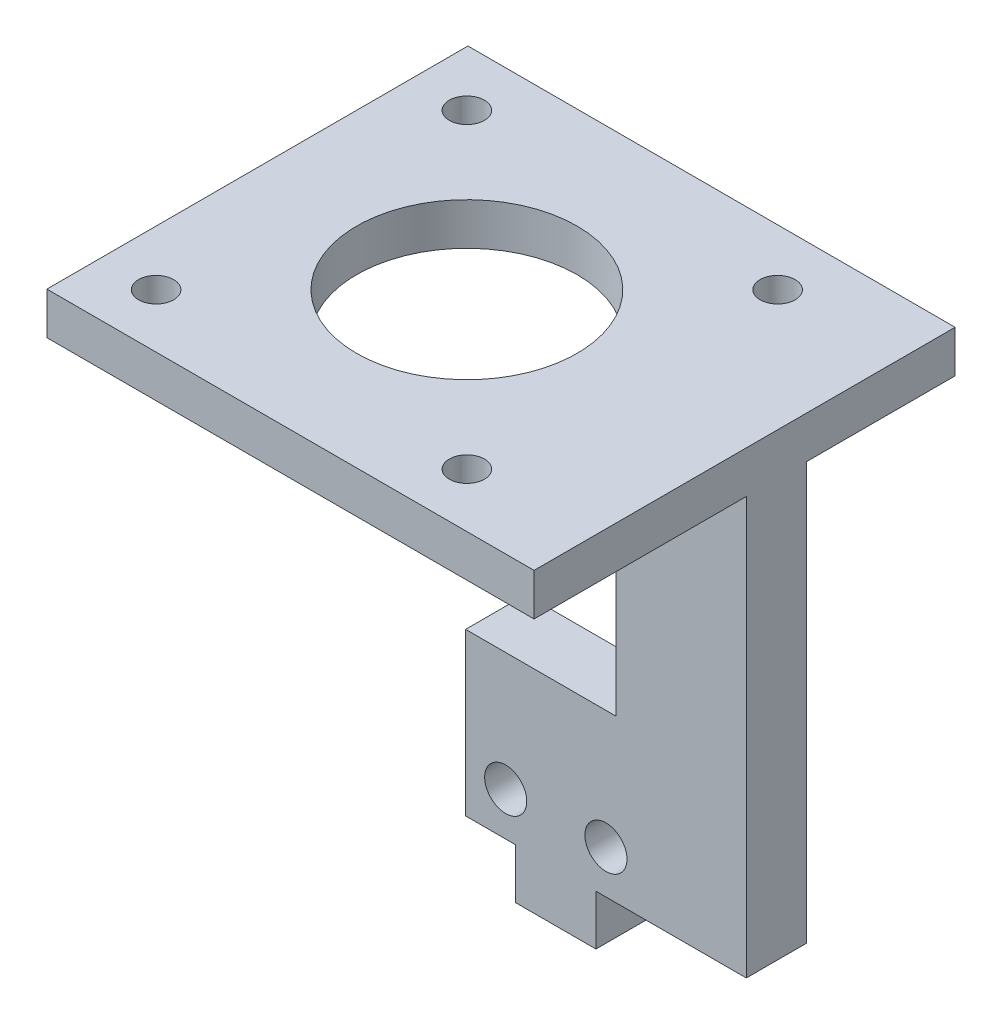
ISO-10303-21;
HEADER;
FILE_DESCRIPTION(('STEP AP214'),'2;1');
FILE_NAME('part.step','',(''),(''),'','','');
FILE_SCHEMA(('AUTOMOTIVE_DESIGN { 1 0 10303 214 1 1 1 1 }'));
ENDSEC;
DATA;
#1=APPLICATION_CONTEXT('core data for automotive mechanical design processes');
#2=APPLICATION_PROTOCOL_DEFINITION('international standard','automotive_design',2000,#1);
#3=PRODUCT_CONTEXT('',#1,'mechanical');
#4=PRODUCT('Part','Part','',(#3));
#5=PRODUCT_RELATED_PRODUCT_CATEGORY('part','',(#4));
#6=PRODUCT_DEFINITION_FORMATION('','',#4);
#7=PRODUCT_DEFINITION_CONTEXT('part definition',#1,'design');
#8=PRODUCT_DEFINITION('design','',#6,#7);
#9=PRODUCT_DEFINITION_SHAPE('','',#8);
#10=(LENGTH_UNIT() NAMED_UNIT(*) SI_UNIT(.MILLI.,.METRE.));
#11=(NAMED_UNIT(*) PLANE_ANGLE_UNIT() SI_UNIT($,.RADIAN.));
#12=(NAMED_UNIT(*) SI_UNIT($,.STERADIAN.) SOLID_ANGLE_UNIT());
#13=UNCERTAINTY_MEASURE_WITH_UNIT(LENGTH_MEASURE(1.E-05),#10,'distance_accuracy_value','');
#14=(GEOMETRIC_REPRESENTATION_CONTEXT(3) GLOBAL_UNCERTAINTY_ASSIGNED_CONTEXT((#13)) GLOBAL_UNIT_ASSIGNED_CONTEXT((#10,
#11,#12)) REPRESENTATION_CONTEXT('',''));
#15=CARTESIAN_POINT('',(0.,0.,0.));
#16=DIRECTION('',(0.,0.,1.));
#17=DIRECTION('',(1.,0.,0.));
#18=AXIS2_PLACEMENT_3D('',#15,#16,#17);
#19=CARTESIAN_POINT('',(0.,0.,6.));
#20=DIRECTION('',(0.,0.,-1.));
#21=DIRECTION('',(-1.,0.,0.));
#22=AXIS2_PLACEMENT_3D('',#19,#20,#21);
#23=PLANE('',#22);
#24=CARTESIAN_POINT('',(14.,4.30447472,6.));
#25=DIRECTION('',(0.,0.,1.));
#26=DIRECTION('',(-1.,0.,0.));
#27=AXIS2_PLACEMENT_3D('',#24,#25,#26);
#28=CIRCLE('',#27,2.1);
#29=CARTESIAN_POINT('',(11.9,4.30447472,6.));
#30=VERTEX_POINT('',#29);
#31=EDGE_CURVE('E229',#30,#30,#28,.T.);
#32=ORIENTED_EDGE('',*,*,#31,.F.);
#33=EDGE_LOOP('',(#32));
#34=FACE_BOUND('',#33,.T.);
#35=CARTESIAN_POINT('',(4.,4.30447472,6.));
#36=DIRECTION('',(0.,0.,1.));
#37=DIRECTION('',(1.,0.,0.));
#38=AXIS2_PLACEMENT_3D('',#35,#36,#37);
#39=CIRCLE('',#38,2.1);
#40=CARTESIAN_POINT('',(6.1,4.30447472,6.));
#41=VERTEX_POINT('',#40);
#42=EDGE_CURVE('E233',#41,#41,#39,.T.);
#43=ORIENTED_EDGE('',*,*,#42,.F.);
#44=EDGE_LOOP('',(#43));
#45=FACE_BOUND('',#44,.T.);
#46=DIRECTION('',(1.,0.,0.));
#47=VECTOR('',#46,1.);
#48=CARTESIAN_POINT('',(0.,41.6,6.));
#49=LINE('',#48,#47);
#50=CARTESIAN_POINT('',(15.,41.6,6.));
#51=VERTEX_POINT('',#50);
#52=CARTESIAN_POINT('',(28.,41.6,6.));
#53=VERTEX_POINT('',#52);
#54=EDGE_CURVE('E176',#51,#53,#49,.T.);
#55=ORIENTED_EDGE('',*,*,#54,.F.);
#56=DIRECTION('',(0.,1.,0.));
#57=VECTOR('',#56,1.);
#58=CARTESIAN_POINT('',(15.,16.1193661254941,6.));
#59=LINE('',#58,#57);
#60=CARTESIAN_POINT('',(15.,16.1193661254941,6.));
#61=VERTEX_POINT('',#60);
#62=EDGE_CURVE('E183',#61,#51,#59,.T.);
#63=ORIENTED_EDGE('',*,*,#62,.F.);
#64=DIRECTION('',(1.,0.,0.));
#65=VECTOR('',#64,1.);
#66=CARTESIAN_POINT('',(0.,16.1193661254941,6.));
#67=LINE('',#66,#65);
#68=CARTESIAN_POINT('',(0.,16.1193661254941,6.));
#69=VERTEX_POINT('',#68);
#70=EDGE_CURVE('E180',#69,#61,#67,.T.);
#71=ORIENTED_EDGE('',*,*,#70,.F.);
#72=DIRECTION('',(0.,-1.,0.));
#73=VECTOR('',#72,1.);
#74=CARTESIAN_POINT('',(0.,0.,6.));
#75=LINE('',#74,#73);
#76=CARTESIAN_POINT('',(0.,0.,6.));
#77=VERTEX_POINT('',#76);
#78=EDGE_CURVE('E242',#69,#77,#75,.T.);
#79=ORIENTED_EDGE('',*,*,#78,.T.);
#80=DIRECTION('',(1.,0.,0.));
#81=VECTOR('',#80,1.);
#82=CARTESIAN_POINT('',(0.,0.,6.));
#83=LINE('',#82,#81);
#84=CARTESIAN_POINT('',(5.,0.,6.));
#85=VERTEX_POINT('',#84);
#86=EDGE_CURVE('E246',#77,#85,#83,.T.);
#87=ORIENTED_EDGE('',*,*,#86,.T.);
#88=DIRECTION('',(0.,1.,0.));
#89=VECTOR('',#88,1.);
#90=CARTESIAN_POINT('',(5.,-5.,6.));
#91=LINE('',#90,#89);
#92=CARTESIAN_POINT('',(5.,-5.,6.));
#93=VERTEX_POINT('',#92);
#94=EDGE_CURVE('E223',#93,#85,#91,.T.);
#95=ORIENTED_EDGE('',*,*,#94,.F.);
#96=DIRECTION('',(-1.,0.,0.));
#97=VECTOR('',#96,1.);
#98=CARTESIAN_POINT('',(13.,-5.,6.));
#99=LINE('',#98,#97);
#100=CARTESIAN_POINT('',(13.,-5.,6.));
#101=VERTEX_POINT('',#100);
#102=EDGE_CURVE('E202',#101,#93,#99,.T.);
#103=ORIENTED_EDGE('',*,*,#102,.F.);
#104=DIRECTION('',(0.,1.,0.));
#105=VECTOR('',#104,1.);
#106=CARTESIAN_POINT('',(13.,-5.,6.));
#107=LINE('',#106,#105);
#108=CARTESIAN_POINT('',(13.,0.,6.));
#109=VERTEX_POINT('',#108);
#110=EDGE_CURVE('E226',#101,#109,#107,.T.);
#111=ORIENTED_EDGE('',*,*,#110,.T.);
#112=CARTESIAN_POINT('',(28.,0.,6.));
#113=VERTEX_POINT('',#112);
#114=EDGE_CURVE('E244',#109,#113,#83,.T.);
#115=ORIENTED_EDGE('',*,*,#114,.T.);
#116=DIRECTION('',(0.,-1.,0.));
#117=VECTOR('',#116,1.);
#118=CARTESIAN_POINT('',(28.,0.,6.));
#119=LINE('',#118,#117);
#120=EDGE_CURVE('E193',#53,#113,#119,.T.);
#121=ORIENTED_EDGE('',*,*,#120,.F.);
#122=EDGE_LOOP('',(#55,#63,#71,#79,#87,#95,#103,#111,#115,#121));
#123=FACE_BOUND('',#122,.T.);
#124=ADVANCED_FACE('F35',(#34,#45,#123),#23,.F.);
#125=CARTESIAN_POINT('',(0.,0.,0.));
#126=DIRECTION('',(0.,0.,-1.));
#127=DIRECTION('',(-1.,0.,0.));
#128=AXIS2_PLACEMENT_3D('',#125,#126,#127);
#129=PLANE('',#128);
#130=CARTESIAN_POINT('',(14.,4.30447472,0.));
#131=DIRECTION('',(0.,0.,1.));
#132=DIRECTION('',(-1.,0.,0.));
#133=AXIS2_PLACEMENT_3D('',#130,#131,#132);
#134=CIRCLE('',#133,2.1);
#135=CARTESIAN_POINT('',(11.9,4.30447472,0.));
#136=VERTEX_POINT('',#135);
#137=EDGE_CURVE('E230',#136,#136,#134,.T.);
#138=ORIENTED_EDGE('',*,*,#137,.T.);
#139=EDGE_LOOP('',(#138));
#140=FACE_BOUND('',#139,.T.);
#141=CARTESIAN_POINT('',(4.,4.30447472,0.));
#142=DIRECTION('',(0.,0.,1.));
#143=DIRECTION('',(1.,0.,0.));
#144=AXIS2_PLACEMENT_3D('',#141,#142,#143);
#145=CIRCLE('',#144,2.1);
#146=CARTESIAN_POINT('',(6.1,4.30447472,0.));
#147=VERTEX_POINT('',#146);
#148=EDGE_CURVE('E236',#147,#147,#145,.T.);
#149=ORIENTED_EDGE('',*,*,#148,.T.);
#150=EDGE_LOOP('',(#149));
#151=FACE_BOUND('',#150,.T.);
#152=DIRECTION('',(0.,-1.,0.));
#153=VECTOR('',#152,1.);
#154=CARTESIAN_POINT('',(15.,0.,0.));
#155=LINE('',#154,#153);
#156=CARTESIAN_POINT('',(15.,41.6,0.));
#157=VERTEX_POINT('',#156);
#158=CARTESIAN_POINT('',(15.,16.1193661254941,0.));
#159=VERTEX_POINT('',#158);
#160=EDGE_CURVE('E57',#157,#159,#155,.T.);
#161=ORIENTED_EDGE('',*,*,#160,.F.);
#162=DIRECTION('',(1.,0.,0.));
#163=VECTOR('',#162,1.);
#164=CARTESIAN_POINT('',(0.,41.6,0.));
#165=LINE('',#164,#163);
#166=CARTESIAN_POINT('',(28.,41.6,0.));
#167=VERTEX_POINT('',#166);
#168=EDGE_CURVE('E169',#157,#167,#165,.T.);
#169=ORIENTED_EDGE('',*,*,#168,.T.);
#170=DIRECTION('',(0.,1.,0.));
#171=VECTOR('',#170,1.);
#172=CARTESIAN_POINT('',(28.,0.,0.));
#173=LINE('',#172,#171);
#174=CARTESIAN_POINT('',(28.,0.,0.));
#175=VERTEX_POINT('',#174);
#176=EDGE_CURVE('E189',#175,#167,#173,.T.);
#177=ORIENTED_EDGE('',*,*,#176,.F.);
#178=DIRECTION('',(1.,0.,0.));
#179=VECTOR('',#178,1.);
#180=CARTESIAN_POINT('',(0.,0.,0.));
#181=LINE('',#180,#179);
#182=CARTESIAN_POINT('',(13.,0.,0.));
#183=VERTEX_POINT('',#182);
#184=EDGE_CURVE('E251',#183,#175,#181,.T.);
#185=ORIENTED_EDGE('',*,*,#184,.F.);
#186=CARTESIAN_POINT('',(5.,0.,0.));
#187=VERTEX_POINT('',#186);
#188=EDGE_CURVE('E253',#187,#183,#181,.T.);
#189=ORIENTED_EDGE('',*,*,#188,.F.);
#190=CARTESIAN_POINT('',(0.,0.,0.));
#191=VERTEX_POINT('',#190);
#192=EDGE_CURVE('E245',#191,#187,#181,.T.);
#193=ORIENTED_EDGE('',*,*,#192,.F.);
#194=DIRECTION('',(0.,-1.,0.));
#195=VECTOR('',#194,1.);
#196=CARTESIAN_POINT('',(0.,0.,0.));
#197=LINE('',#196,#195);
#198=CARTESIAN_POINT('',(0.,16.1193661254941,0.));
#199=VERTEX_POINT('',#198);
#200=EDGE_CURVE('E239',#199,#191,#197,.T.);
#201=ORIENTED_EDGE('',*,*,#200,.F.);
#202=DIRECTION('',(-1.,0.,0.));
#203=VECTOR('',#202,1.);
#204=CARTESIAN_POINT('',(0.,16.1193661254941,0.));
#205=LINE('',#204,#203);
#206=EDGE_CURVE('E256',#159,#199,#205,.T.);
#207=ORIENTED_EDGE('',*,*,#206,.F.);
#208=EDGE_LOOP('',(#161,#169,#177,#185,#189,#193,#201,#207));
#209=FACE_BOUND('',#208,.T.);
#210=ADVANCED_FACE('F304',(#140,#151,#209),#129,.T.);
#211=CARTESIAN_POINT('',(15.,16.1193661254941,-4.));
#212=DIRECTION('',(1.,0.,0.));
#213=DIRECTION('',(0.,0.,-1.));
#214=AXIS2_PLACEMENT_3D('',#211,#212,#213);
#215=PLANE('',#214);
#216=DIRECTION('',(0.,0.,1.));
#217=VECTOR('',#216,1.);
#218=CARTESIAN_POINT('',(15.,41.6,-4.));
#219=LINE('',#218,#217);
#220=EDGE_CURVE('E43',#157,#51,#219,.T.);
#221=ORIENTED_EDGE('',*,*,#220,.F.);
#222=ORIENTED_EDGE('',*,*,#160,.T.);
#223=DIRECTION('',(0.,0.,1.));
#224=VECTOR('',#223,1.);
#225=CARTESIAN_POINT('',(15.,16.1193661254941,-4.));
#226=LINE('',#225,#224);
#227=EDGE_CURVE('E187',#159,#61,#226,.T.);
#228=ORIENTED_EDGE('',*,*,#227,.T.);
#229=ORIENTED_EDGE('',*,*,#62,.T.);
#230=EDGE_LOOP('',(#221,#222,#228,#229));
#231=FACE_BOUND('',#230,.T.);
#232=ADVANCED_FACE('F268',(#231),#215,.F.);
#233=CARTESIAN_POINT('',(28.,0.,0.));
#234=DIRECTION('',(1.,0.,0.));
#235=DIRECTION('',(0.,1.,0.));
#236=AXIS2_PLACEMENT_3D('',#233,#234,#235);
#237=PLANE('',#236);
#238=DIRECTION('',(0.,0.,-1.));
#239=VECTOR('',#238,1.);
#240=CARTESIAN_POINT('',(28.,45.8,6.));
#241=LINE('',#240,#239);
#242=CARTESIAN_POINT('',(28.,45.8,27.17));
#243=VERTEX_POINT('',#242);
#244=CARTESIAN_POINT('',(28.,45.8,-14.83));
#245=VERTEX_POINT('',#244);
#246=EDGE_CURVE('E178',#243,#245,#241,.T.);
#247=ORIENTED_EDGE('',*,*,#246,.F.);
#248=DIRECTION('',(0.,1.,0.));
#249=VECTOR('',#248,1.);
#250=CARTESIAN_POINT('',(28.,41.6,27.17));
#251=LINE('',#250,#249);
#252=CARTESIAN_POINT('',(28.,41.6,27.17));
#253=VERTEX_POINT('',#252);
#254=EDGE_CURVE('E160',#253,#243,#251,.T.);
#255=ORIENTED_EDGE('',*,*,#254,.F.);
#256=DIRECTION('',(0.,0.,-1.));
#257=VECTOR('',#256,1.);
#258=CARTESIAN_POINT('',(28.,41.6,27.17));
#259=LINE('',#258,#257);
#260=EDGE_CURVE('E163',#253,#53,#259,.T.);
#261=ORIENTED_EDGE('',*,*,#260,.T.);
#262=ORIENTED_EDGE('',*,*,#120,.T.);
#263=DIRECTION('',(0.,0.,-1.));
#264=VECTOR('',#263,1.);
#265=CARTESIAN_POINT('',(28.,0.,0.));
#266=LINE('',#265,#264);
#267=EDGE_CURVE('E195',#113,#175,#266,.T.);
#268=ORIENTED_EDGE('',*,*,#267,.T.);
#269=ORIENTED_EDGE('',*,*,#176,.T.);
#270=CARTESIAN_POINT('',(28.,41.6,-14.83));
#271=VERTEX_POINT('',#270);
#272=EDGE_CURVE('E161',#167,#271,#259,.T.);
#273=ORIENTED_EDGE('',*,*,#272,.T.);
#274=DIRECTION('',(0.,1.,0.));
#275=VECTOR('',#274,1.);
#276=CARTESIAN_POINT('',(28.,41.6,-14.83));
#277=LINE('',#276,#275);
#278=EDGE_CURVE('E170',#271,#245,#277,.T.);
#279=ORIENTED_EDGE('',*,*,#278,.T.);
#280=EDGE_LOOP('',(#247,#255,#261,#262,#268,#269,#273,#279));
#281=FACE_BOUND('',#280,.T.);
#282=ADVANCED_FACE('F334',(#281),#237,.T.);
#283=CARTESIAN_POINT('',(0.,0.,6.));
#284=DIRECTION('',(0.,1.,0.));
#285=DIRECTION('',(0.,0.,1.));
#286=AXIS2_PLACEMENT_3D('',#283,#284,#285);
#287=PLANE('',#286);
#288=DIRECTION('',(0.,0.,1.));
#289=VECTOR('',#288,1.);
#290=CARTESIAN_POINT('',(13.,0.,6.));
#291=LINE('',#290,#289);
#292=EDGE_CURVE('E213',#183,#109,#291,.T.);
#293=ORIENTED_EDGE('',*,*,#292,.F.);
#294=ORIENTED_EDGE('',*,*,#184,.T.);
#295=ORIENTED_EDGE('',*,*,#267,.F.);
#296=ORIENTED_EDGE('',*,*,#114,.F.);
#297=EDGE_LOOP('',(#293,#294,#295,#296));
#298=FACE_BOUND('',#297,.T.);
#299=ADVANCED_FACE('F300',(#298),#287,.F.);
#300=DIRECTION('',(0.,0.,-1.));
#301=VECTOR('',#300,1.);
#302=CARTESIAN_POINT('',(5.,0.,6.));
#303=LINE('',#302,#301);
#304=EDGE_CURVE('E214',#85,#187,#303,.T.);
#305=ORIENTED_EDGE('',*,*,#304,.F.);
#306=ORIENTED_EDGE('',*,*,#86,.F.);
#307=DIRECTION('',(0.,0.,-1.));
#308=VECTOR('',#307,1.);
#309=CARTESIAN_POINT('',(0.,0.,6.));
#310=LINE('',#309,#308);
#311=EDGE_CURVE('E249',#77,#191,#310,.T.);
#312=ORIENTED_EDGE('',*,*,#311,.T.);
#313=ORIENTED_EDGE('',*,*,#192,.T.);
#314=EDGE_LOOP('',(#305,#306,#312,#313));
#315=FACE_BOUND('',#314,.T.);
#316=ADVANCED_FACE('F280',(#315),#287,.F.);
#317=CARTESIAN_POINT('',(0.,0.,6.));
#318=DIRECTION('',(1.,0.,0.));
#319=DIRECTION('',(0.,1.,0.));
#320=AXIS2_PLACEMENT_3D('',#317,#318,#319);
#321=PLANE('',#320);
#322=ORIENTED_EDGE('',*,*,#78,.F.);
#323=DIRECTION('',(0.,0.,1.));
#324=VECTOR('',#323,1.);
#325=CARTESIAN_POINT('',(0.,16.1193661254941,-4.));
#326=LINE('',#325,#324);
#327=EDGE_CURVE('E186',#199,#69,#326,.T.);
#328=ORIENTED_EDGE('',*,*,#327,.F.);
#329=ORIENTED_EDGE('',*,*,#200,.T.);
#330=ORIENTED_EDGE('',*,*,#311,.F.);
#331=EDGE_LOOP('',(#322,#328,#329,#330));
#332=FACE_BOUND('',#331,.T.);
#333=ADVANCED_FACE('F37',(#332),#321,.F.);
#334=CARTESIAN_POINT('',(4.,4.30447472,0.));
#335=DIRECTION('',(0.,0.,1.));
#336=DIRECTION('',(1.,0.,0.));
#337=AXIS2_PLACEMENT_3D('',#334,#335,#336);
#338=CYLINDRICAL_SURFACE('',#337,2.1);
#339=ORIENTED_EDGE('',*,*,#148,.F.);
#340=EDGE_LOOP('',(#339));
#341=FACE_BOUND('',#340,.T.);
#342=ORIENTED_EDGE('',*,*,#42,.T.);
#343=EDGE_LOOP('',(#342));
#344=FACE_BOUND('',#343,.T.);
#345=ADVANCED_FACE('F331',(#341,#344),#338,.F.);
#346=CARTESIAN_POINT('',(14.,4.30447472,0.));
#347=DIRECTION('',(0.,0.,1.));
#348=DIRECTION('',(1.,0.,0.));
#349=AXIS2_PLACEMENT_3D('',#346,#347,#348);
#350=CYLINDRICAL_SURFACE('',#349,2.1);
#351=ORIENTED_EDGE('',*,*,#137,.F.);
#352=EDGE_LOOP('',(#351));
#353=FACE_BOUND('',#352,.T.);
#354=ORIENTED_EDGE('',*,*,#31,.T.);
#355=EDGE_LOOP('',(#354));
#356=FACE_BOUND('',#355,.T.);
#357=ADVANCED_FACE('F566',(#353,#356),#350,.F.);
#358=CARTESIAN_POINT('',(13.,-5.,6.));
#359=DIRECTION('',(-1.,0.,0.));
#360=DIRECTION('',(0.,0.,1.));
#361=AXIS2_PLACEMENT_3D('',#358,#359,#360);
#362=PLANE('',#361);
#363=CARTESIAN_POINT('',(13.,0.,-4.));
#364=VERTEX_POINT('',#363);
#365=EDGE_CURVE('E198',#364,#183,#291,.T.);
#366=ORIENTED_EDGE('',*,*,#365,.T.);
#367=ORIENTED_EDGE('',*,*,#292,.T.);
#368=ORIENTED_EDGE('',*,*,#110,.F.);
#369=DIRECTION('',(0.,0.,1.));
#370=VECTOR('',#369,1.);
#371=CARTESIAN_POINT('',(13.,-5.,6.));
#372=LINE('',#371,#370);
#373=CARTESIAN_POINT('',(13.,-5.,-4.));
#374=VERTEX_POINT('',#373);
#375=EDGE_CURVE('E199',#374,#101,#372,.T.);
#376=ORIENTED_EDGE('',*,*,#375,.F.);
#377=DIRECTION('',(0.,1.,0.));
#378=VECTOR('',#377,1.);
#379=CARTESIAN_POINT('',(13.,-5.,-4.));
#380=LINE('',#379,#378);
#381=EDGE_CURVE('E209',#374,#364,#380,.T.);
#382=ORIENTED_EDGE('',*,*,#381,.T.);
#383=EDGE_LOOP('',(#366,#367,#368,#376,#382));
#384=FACE_BOUND('',#383,.T.);
#385=ADVANCED_FACE('F296',(#384),#362,.F.);
#386=CARTESIAN_POINT('',(5.,-5.,6.));
#387=DIRECTION('',(1.,0.,0.));
#388=DIRECTION('',(0.,0.,-1.));
#389=AXIS2_PLACEMENT_3D('',#386,#387,#388);
#390=PLANE('',#389);
#391=ORIENTED_EDGE('',*,*,#304,.T.);
#392=CARTESIAN_POINT('',(5.,0.,-4.));
#393=VERTEX_POINT('',#392);
#394=EDGE_CURVE('E212',#187,#393,#303,.T.);
#395=ORIENTED_EDGE('',*,*,#394,.T.);
#396=DIRECTION('',(0.,1.,0.));
#397=VECTOR('',#396,1.);
#398=CARTESIAN_POINT('',(5.,-5.,-4.));
#399=LINE('',#398,#397);
#400=CARTESIAN_POINT('',(5.,-5.,-4.));
#401=VERTEX_POINT('',#400);
#402=EDGE_CURVE('E220',#401,#393,#399,.T.);
#403=ORIENTED_EDGE('',*,*,#402,.F.);
#404=DIRECTION('',(0.,0.,-1.));
#405=VECTOR('',#404,1.);
#406=CARTESIAN_POINT('',(5.,-5.,6.));
#407=LINE('',#406,#405);
#408=EDGE_CURVE('E205',#93,#401,#407,.T.);
#409=ORIENTED_EDGE('',*,*,#408,.F.);
#410=ORIENTED_EDGE('',*,*,#94,.T.);
#411=EDGE_LOOP('',(#391,#395,#403,#409,#410));
#412=FACE_BOUND('',#411,.T.);
#413=ADVANCED_FACE('F285',(#412),#390,.F.);
#414=CARTESIAN_POINT('',(13.,-5.,-4.));
#415=DIRECTION('',(0.,0.,1.));
#416=DIRECTION('',(1.,0.,0.));
#417=AXIS2_PLACEMENT_3D('',#414,#415,#416);
#418=PLANE('',#417);
#419=DIRECTION('',(1.,0.,0.));
#420=VECTOR('',#419,1.);
#421=CARTESIAN_POINT('',(13.,0.,-4.));
#422=LINE('',#421,#420);
#423=EDGE_CURVE('E203',#393,#364,#422,.T.);
#424=ORIENTED_EDGE('',*,*,#423,.T.);
#425=ORIENTED_EDGE('',*,*,#381,.F.);
#426=DIRECTION('',(1.,0.,0.));
#427=VECTOR('',#426,1.);
#428=CARTESIAN_POINT('',(13.,-5.,-4.));
#429=LINE('',#428,#427);
#430=EDGE_CURVE('E207',#401,#374,#429,.T.);
#431=ORIENTED_EDGE('',*,*,#430,.F.);
#432=ORIENTED_EDGE('',*,*,#402,.T.);
#433=EDGE_LOOP('',(#424,#425,#431,#432));
#434=FACE_BOUND('',#433,.T.);
#435=ADVANCED_FACE('F310',(#434),#418,.F.);
#436=CARTESIAN_POINT('',(0.,-5.,0.));
#437=DIRECTION('',(0.,1.,0.));
#438=DIRECTION('',(0.,0.,1.));
#439=AXIS2_PLACEMENT_3D('',#436,#437,#438);
#440=PLANE('',#439);
#441=ORIENTED_EDGE('',*,*,#375,.T.);
#442=ORIENTED_EDGE('',*,*,#102,.T.);
#443=ORIENTED_EDGE('',*,*,#408,.T.);
#444=ORIENTED_EDGE('',*,*,#430,.T.);
#445=EDGE_LOOP('',(#441,#442,#443,#444));
#446=FACE_BOUND('',#445,.T.);
#447=ADVANCED_FACE('F289',(#446),#440,.F.);
#448=CARTESIAN_POINT('',(0.,0.,0.));
#449=DIRECTION('',(0.,1.,0.));
#450=DIRECTION('',(0.,0.,1.));
#451=AXIS2_PLACEMENT_3D('',#448,#449,#450);
#452=PLANE('',#451);
#453=ORIENTED_EDGE('',*,*,#394,.F.);
#454=ORIENTED_EDGE('',*,*,#188,.T.);
#455=ORIENTED_EDGE('',*,*,#365,.F.);
#456=ORIENTED_EDGE('',*,*,#423,.F.);
#457=EDGE_LOOP('',(#453,#454,#455,#456));
#458=FACE_BOUND('',#457,.T.);
#459=ADVANCED_FACE('F307',(#458),#452,.T.);
#460=CARTESIAN_POINT('',(0.,16.1193661254941,-4.));
#461=DIRECTION('',(0.,-1.,0.));
#462=DIRECTION('',(0.,0.,-1.));
#463=AXIS2_PLACEMENT_3D('',#460,#461,#462);
#464=PLANE('',#463);
#465=ORIENTED_EDGE('',*,*,#206,.T.);
#466=ORIENTED_EDGE('',*,*,#327,.T.);
#467=ORIENTED_EDGE('',*,*,#70,.T.);
#468=ORIENTED_EDGE('',*,*,#227,.F.);
#469=EDGE_LOOP('',(#465,#466,#467,#468));
#470=FACE_BOUND('',#469,.T.);
#471=ADVANCED_FACE('F271',(#470),#464,.F.);
#472=CARTESIAN_POINT('',(0.,45.8,0.));
#473=DIRECTION('',(0.,1.,0.));
#474=DIRECTION('',(0.,0.,1.));
#475=AXIS2_PLACEMENT_3D('',#472,#473,#474);
#476=PLANE('',#475);
#477=CARTESIAN_POINT('',(0.402372169999988,45.8,6.27620458000001));
#478=DIRECTION('',(0.,1.,0.));
#479=DIRECTION('',(0.,0.,1.));
#480=AXIS2_PLACEMENT_3D('',#477,#478,#479);
#481=CIRCLE('',#480,11.);
#482=CARTESIAN_POINT('',(0.402372169999988,45.8,17.27620458));
#483=VERTEX_POINT('',#482);
#484=EDGE_CURVE('E395',#483,#483,#481,.T.);
#485=ORIENTED_EDGE('',*,*,#484,.F.);
#486=EDGE_LOOP('',(#485));
#487=FACE_BOUND('',#486,.T.);
#488=CARTESIAN_POINT('',(-15.09762783,45.8,-9.22379542));
#489=DIRECTION('',(0.,1.,0.));
#490=DIRECTION('',(0.,0.,1.));
#491=AXIS2_PLACEMENT_3D('',#488,#489,#490);
#492=CIRCLE('',#491,1.75);
#493=CARTESIAN_POINT('',(-15.09762783,45.8,-7.47379542));
#494=VERTEX_POINT('',#493);
#495=EDGE_CURVE('E417',#494,#494,#492,.T.);
#496=ORIENTED_EDGE('',*,*,#495,.F.);
#497=EDGE_LOOP('',(#496));
#498=FACE_BOUND('',#497,.T.);
#499=CARTESIAN_POINT('',(15.90237217,45.8,21.77620458));
#500=DIRECTION('',(0.,1.,0.));
#501=DIRECTION('',(0.,0.,1.));
#502=AXIS2_PLACEMENT_3D('',#499,#500,#501);
#503=CIRCLE('',#502,1.75);
#504=CARTESIAN_POINT('',(15.90237217,45.8,23.52620458));
#505=VERTEX_POINT('',#504);
#506=EDGE_CURVE('E414',#505,#505,#503,.T.);
#507=ORIENTED_EDGE('',*,*,#506,.F.);
#508=EDGE_LOOP('',(#507));
#509=FACE_BOUND('',#508,.T.);
#510=CARTESIAN_POINT('',(-15.09762783,45.8,21.77620458));
#511=DIRECTION('',(0.,1.,0.));
#512=DIRECTION('',(0.,0.,1.));
#513=AXIS2_PLACEMENT_3D('',#510,#511,#512);
#514=CIRCLE('',#513,1.75);
#515=CARTESIAN_POINT('',(-15.09762783,45.8,23.52620458));
#516=VERTEX_POINT('',#515);
#517=EDGE_CURVE('E406',#516,#516,#514,.T.);
#518=ORIENTED_EDGE('',*,*,#517,.F.);
#519=EDGE_LOOP('',(#518));
#520=FACE_BOUND('',#519,.T.);
#521=CARTESIAN_POINT('',(15.90237217,45.8,-9.22379542));
#522=DIRECTION('',(0.,1.,0.));
#523=DIRECTION('',(0.,0.,1.));
#524=AXIS2_PLACEMENT_3D('',#521,#522,#523);
#525=CIRCLE('',#524,1.75);
#526=CARTESIAN_POINT('',(15.90237217,45.8,-7.47379542));
#527=VERTEX_POINT('',#526);
#528=EDGE_CURVE('E147',#527,#527,#525,.T.);
#529=ORIENTED_EDGE('',*,*,#528,.F.);
#530=EDGE_LOOP('',(#529));
#531=FACE_BOUND('',#530,.T.);
#532=DIRECTION('',(0.,0.,-1.));
#533=VECTOR('',#532,1.);
#534=CARTESIAN_POINT('',(-20.597266504442,45.8,27.17));
#535=LINE('',#534,#533);
#536=CARTESIAN_POINT('',(-20.597266504442,45.8,27.17));
#537=VERTEX_POINT('',#536);
#538=CARTESIAN_POINT('',(-20.597266504442,45.8,-14.83));
#539=VERTEX_POINT('',#538);
#540=EDGE_CURVE('E49',#537,#539,#535,.T.);
#541=ORIENTED_EDGE('',*,*,#540,.F.);
#542=DIRECTION('',(1.,0.,0.));
#543=VECTOR('',#542,1.);
#544=CARTESIAN_POINT('',(28.,45.8,27.17));
#545=LINE('',#544,#543);
#546=EDGE_CURVE('E152',#537,#243,#545,.T.);
#547=ORIENTED_EDGE('',*,*,#546,.T.);
#548=ORIENTED_EDGE('',*,*,#246,.T.);
#549=DIRECTION('',(-1.,0.,0.));
#550=VECTOR('',#549,1.);
#551=CARTESIAN_POINT('',(28.,45.8,-14.83));
#552=LINE('',#551,#550);
#553=EDGE_CURVE('E155',#245,#539,#552,.T.);
#554=ORIENTED_EDGE('',*,*,#553,.T.);
#555=EDGE_LOOP('',(#541,#547,#548,#554));
#556=FACE_BOUND('',#555,.T.);
#557=ADVANCED_FACE('F151',(#487,#498,#509,#520,#531,#556),#476,.T.);
#558=CARTESIAN_POINT('',(0.,41.6,0.));
#559=DIRECTION('',(0.,1.,0.));
#560=DIRECTION('',(0.,0.,1.));
#561=AXIS2_PLACEMENT_3D('',#558,#559,#560);
#562=PLANE('',#561);
#563=CARTESIAN_POINT('',(0.402372169999988,41.6,6.27620458000001));
#564=DIRECTION('',(0.,-1.,0.));
#565=DIRECTION('',(0.,0.,-1.));
#566=AXIS2_PLACEMENT_3D('',#563,#564,#565);
#567=CIRCLE('',#566,11.);
#568=CARTESIAN_POINT('',(0.402372169999988,41.6,-4.72379541999999));
#569=VERTEX_POINT('',#568);
#570=EDGE_CURVE('E398',#569,#569,#567,.T.);
#571=ORIENTED_EDGE('',*,*,#570,.F.);
#572=EDGE_LOOP('',(#571));
#573=FACE_BOUND('',#572,.T.);
#574=CARTESIAN_POINT('',(-15.09762783,41.6,-9.22379542));
#575=DIRECTION('',(0.,-1.,0.));
#576=DIRECTION('',(0.,0.,1.));
#577=AXIS2_PLACEMENT_3D('',#574,#575,#576);
#578=CIRCLE('',#577,1.75);
#579=CARTESIAN_POINT('',(-15.09762783,41.6,-7.47379542));
#580=VERTEX_POINT('',#579);
#581=EDGE_CURVE('E403',#580,#580,#578,.T.);
#582=ORIENTED_EDGE('',*,*,#581,.F.);
#583=EDGE_LOOP('',(#582));
#584=FACE_BOUND('',#583,.T.);
#585=CARTESIAN_POINT('',(15.90237217,41.6,21.77620458));
#586=DIRECTION('',(0.,-1.,0.));
#587=DIRECTION('',(0.,0.,1.));
#588=AXIS2_PLACEMENT_3D('',#585,#586,#587);
#589=CIRCLE('',#588,1.75);
#590=CARTESIAN_POINT('',(15.90237217,41.6,23.52620458));
#591=VERTEX_POINT('',#590);
#592=EDGE_CURVE('E407',#591,#591,#589,.T.);
#593=ORIENTED_EDGE('',*,*,#592,.F.);
#594=EDGE_LOOP('',(#593));
#595=FACE_BOUND('',#594,.T.);
#596=CARTESIAN_POINT('',(-15.09762783,41.6,21.77620458));
#597=DIRECTION('',(0.,-1.,0.));
#598=DIRECTION('',(0.,0.,-1.));
#599=AXIS2_PLACEMENT_3D('',#596,#597,#598);
#600=CIRCLE('',#599,1.75);
#601=CARTESIAN_POINT('',(-15.09762783,41.6,20.02620458));
#602=VERTEX_POINT('',#601);
#603=EDGE_CURVE('E400',#602,#602,#600,.T.);
#604=ORIENTED_EDGE('',*,*,#603,.F.);
#605=EDGE_LOOP('',(#604));
#606=FACE_BOUND('',#605,.T.);
#607=CARTESIAN_POINT('',(15.90237217,41.6,-9.22379542));
#608=DIRECTION('',(0.,-1.,0.));
#609=DIRECTION('',(0.,0.,-1.));
#610=AXIS2_PLACEMENT_3D('',#607,#608,#609);
#611=CIRCLE('',#610,1.75);
#612=CARTESIAN_POINT('',(15.90237217,41.6,-10.97379542));
#613=VERTEX_POINT('',#612);
#614=EDGE_CURVE('E420',#613,#613,#611,.T.);
#615=ORIENTED_EDGE('',*,*,#614,.F.);
#616=EDGE_LOOP('',(#615));
#617=FACE_BOUND('',#616,.T.);
#618=DIRECTION('',(1.,0.,0.));
#619=VECTOR('',#618,1.);
#620=CARTESIAN_POINT('',(28.,41.6,27.17));
#621=LINE('',#620,#619);
#622=CARTESIAN_POINT('',(-20.597266504442,41.6,27.17));
#623=VERTEX_POINT('',#622);
#624=EDGE_CURVE('E173',#623,#253,#621,.T.);
#625=ORIENTED_EDGE('',*,*,#624,.F.);
#626=DIRECTION('',(0.,0.,-1.));
#627=VECTOR('',#626,1.);
#628=CARTESIAN_POINT('',(-20.597266504442,41.6,0.));
#629=LINE('',#628,#627);
#630=CARTESIAN_POINT('',(-20.597266504442,41.6,-14.83));
#631=VERTEX_POINT('',#630);
#632=EDGE_CURVE('E143',#623,#631,#629,.T.);
#633=ORIENTED_EDGE('',*,*,#632,.T.);
#634=DIRECTION('',(-1.,0.,0.));
#635=VECTOR('',#634,1.);
#636=CARTESIAN_POINT('',(28.,41.6,-14.83));
#637=LINE('',#636,#635);
#638=EDGE_CURVE('E426',#271,#631,#637,.T.);
#639=ORIENTED_EDGE('',*,*,#638,.F.);
#640=ORIENTED_EDGE('',*,*,#272,.F.);
#641=ORIENTED_EDGE('',*,*,#168,.F.);
#642=ORIENTED_EDGE('',*,*,#220,.T.);
#643=ORIENTED_EDGE('',*,*,#54,.T.);
#644=ORIENTED_EDGE('',*,*,#260,.F.);
#645=EDGE_LOOP('',(#625,#633,#639,#640,#641,#642,#643,#644));
#646=FACE_BOUND('',#645,.T.);
#647=ADVANCED_FACE('F260',(#573,#584,#595,#606,#617,#646),#562,.F.);
#648=CARTESIAN_POINT('',(28.,41.6,27.17));
#649=DIRECTION('',(0.,0.,1.));
#650=DIRECTION('',(1.,0.,0.));
#651=AXIS2_PLACEMENT_3D('',#648,#649,#650);
#652=PLANE('',#651);
#653=DIRECTION('',(0.,1.,0.));
#654=VECTOR('',#653,1.);
#655=CARTESIAN_POINT('',(-20.597266504442,45.8,27.17));
#656=LINE('',#655,#654);
#657=EDGE_CURVE('E140',#623,#537,#656,.T.);
#658=ORIENTED_EDGE('',*,*,#657,.F.);
#659=ORIENTED_EDGE('',*,*,#624,.T.);
#660=ORIENTED_EDGE('',*,*,#254,.T.);
#661=ORIENTED_EDGE('',*,*,#546,.F.);
#662=EDGE_LOOP('',(#658,#659,#660,#661));
#663=FACE_BOUND('',#662,.T.);
#664=ADVANCED_FACE('F158',(#663),#652,.T.);
#665=CARTESIAN_POINT('',(28.,41.6,-14.83));
#666=DIRECTION('',(0.,0.,-1.));
#667=DIRECTION('',(-1.,0.,0.));
#668=AXIS2_PLACEMENT_3D('',#665,#666,#667);
#669=PLANE('',#668);
#670=DIRECTION('',(0.,-1.,0.));
#671=VECTOR('',#670,1.);
#672=CARTESIAN_POINT('',(-20.597266504442,41.6,-14.83));
#673=LINE('',#672,#671);
#674=EDGE_CURVE('E11',#539,#631,#673,.T.);
#675=ORIENTED_EDGE('',*,*,#674,.F.);
#676=ORIENTED_EDGE('',*,*,#553,.F.);
#677=ORIENTED_EDGE('',*,*,#278,.F.);
#678=ORIENTED_EDGE('',*,*,#638,.T.);
#679=EDGE_LOOP('',(#675,#676,#677,#678));
#680=FACE_BOUND('',#679,.T.);
#681=ADVANCED_FACE('F364',(#680),#669,.T.);
#682=CARTESIAN_POINT('',(-20.597266504442,0.,0.));
#683=DIRECTION('',(1.,0.,0.));
#684=DIRECTION('',(0.,0.,-1.));
#685=AXIS2_PLACEMENT_3D('',#682,#683,#684);
#686=PLANE('',#685);
#687=ORIENTED_EDGE('',*,*,#657,.T.);
#688=ORIENTED_EDGE('',*,*,#540,.T.);
#689=ORIENTED_EDGE('',*,*,#674,.T.);
#690=ORIENTED_EDGE('',*,*,#632,.F.);
#691=EDGE_LOOP('',(#687,#688,#689,#690));
#692=FACE_BOUND('',#691,.T.);
#693=ADVANCED_FACE('F141',(#692),#686,.F.);
#694=CARTESIAN_POINT('',(15.90237217,51.55,-9.22379542));
#695=DIRECTION('',(0.,-1.,0.));
#696=DIRECTION('',(0.,0.,-1.));
#697=AXIS2_PLACEMENT_3D('',#694,#695,#696);
#698=CYLINDRICAL_SURFACE('',#697,1.75);
#699=ORIENTED_EDGE('',*,*,#528,.T.);
#700=EDGE_LOOP('',(#699));
#701=FACE_BOUND('',#700,.T.);
#702=ORIENTED_EDGE('',*,*,#614,.T.);
#703=EDGE_LOOP('',(#702));
#704=FACE_BOUND('',#703,.T.);
#705=ADVANCED_FACE('F372',(#701,#704),#698,.F.);
#706=CARTESIAN_POINT('',(-15.09762783,51.55,21.77620458));
#707=DIRECTION('',(0.,-1.,0.));
#708=DIRECTION('',(0.,0.,-1.));
#709=AXIS2_PLACEMENT_3D('',#706,#707,#708);
#710=CYLINDRICAL_SURFACE('',#709,1.75);
#711=ORIENTED_EDGE('',*,*,#517,.T.);
#712=EDGE_LOOP('',(#711));
#713=FACE_BOUND('',#712,.T.);
#714=ORIENTED_EDGE('',*,*,#603,.T.);
#715=EDGE_LOOP('',(#714));
#716=FACE_BOUND('',#715,.T.);
#717=ADVANCED_FACE('F375',(#713,#716),#710,.F.);
#718=CARTESIAN_POINT('',(15.90237217,51.55,21.77620458));
#719=DIRECTION('',(0.,-1.,0.));
#720=DIRECTION('',(0.,0.,-1.));
#721=AXIS2_PLACEMENT_3D('',#718,#719,#720);
#722=CYLINDRICAL_SURFACE('',#721,1.75);
#723=ORIENTED_EDGE('',*,*,#506,.T.);
#724=EDGE_LOOP('',(#723));
#725=FACE_BOUND('',#724,.T.);
#726=ORIENTED_EDGE('',*,*,#592,.T.);
#727=EDGE_LOOP('',(#726));
#728=FACE_BOUND('',#727,.T.);
#729=ADVANCED_FACE('F379',(#725,#728),#722,.F.);
#730=CARTESIAN_POINT('',(-15.09762783,51.55,-9.22379542));
#731=DIRECTION('',(0.,-1.,0.));
#732=DIRECTION('',(0.,0.,-1.));
#733=AXIS2_PLACEMENT_3D('',#730,#731,#732);
#734=CYLINDRICAL_SURFACE('',#733,1.75);
#735=ORIENTED_EDGE('',*,*,#495,.T.);
#736=EDGE_LOOP('',(#735));
#737=FACE_BOUND('',#736,.T.);
#738=ORIENTED_EDGE('',*,*,#581,.T.);
#739=EDGE_LOOP('',(#738));
#740=FACE_BOUND('',#739,.T.);
#741=ADVANCED_FACE('F383',(#737,#740),#734,.F.);
#742=CARTESIAN_POINT('',(0.402372169999988,51.6,6.27620458000001));
#743=DIRECTION('',(0.,-1.,0.));
#744=DIRECTION('',(0.,0.,-1.));
#745=AXIS2_PLACEMENT_3D('',#742,#743,#744);
#746=CYLINDRICAL_SURFACE('',#745,11.);
#747=ORIENTED_EDGE('',*,*,#484,.T.);
#748=EDGE_LOOP('',(#747));
#749=FACE_BOUND('',#748,.T.);
#750=ORIENTED_EDGE('',*,*,#570,.T.);
#751=EDGE_LOOP('',(#750));
#752=FACE_BOUND('',#751,.T.);
#753=ADVANCED_FACE('F387',(#749,#752),#746,.F.);
#754=CLOSED_SHELL('',(#124,#210,#232,#282,#299,#316,#333,#345,#357,#385,#413,#435,#447,#459,
#471,#557,#647,#664,#681,#693,#705,#717,#729,#741,#753));
#755=MANIFOLD_SOLID_BREP('B2',#754);
#756=ADVANCED_BREP_SHAPE_REPRESENTATION('',(#18,#755),#14);
#757=SHAPE_DEFINITION_REPRESENTATION(#9,#756);
ENDSEC;
END-ISO-10303-21;
